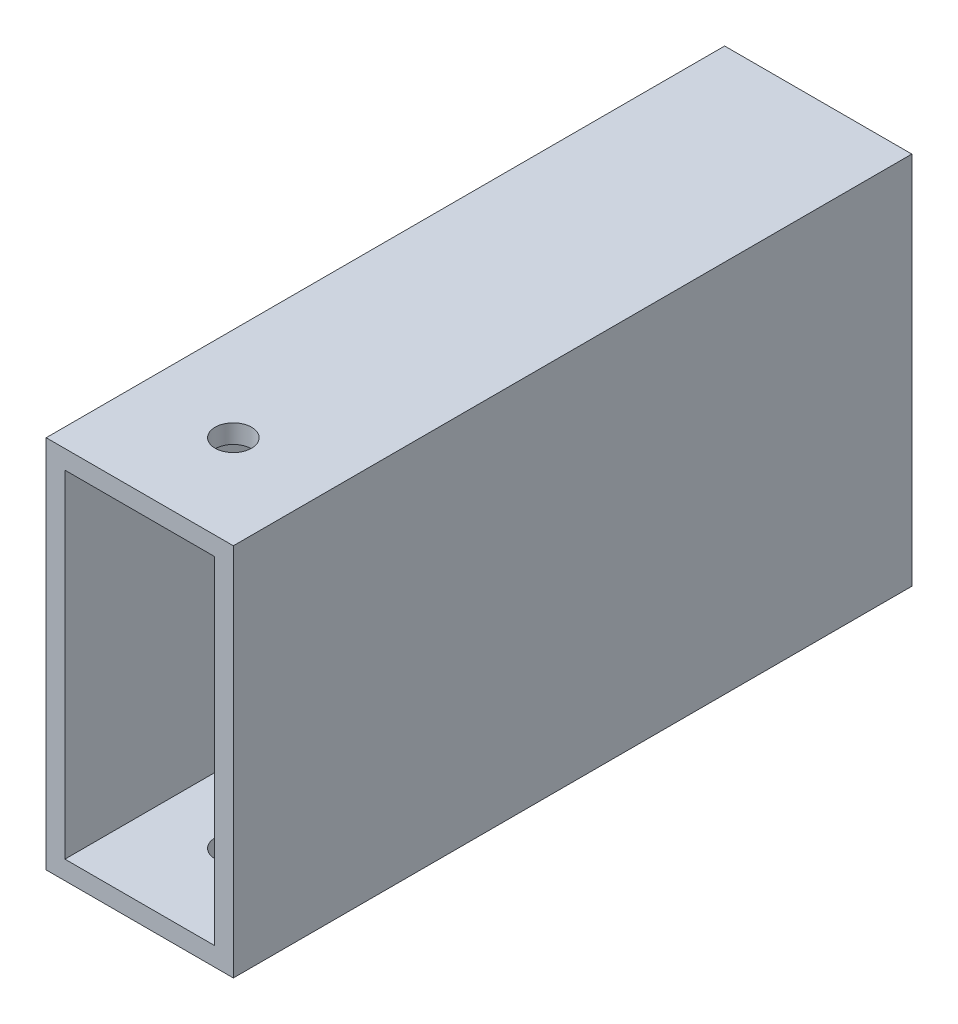
ISO-10303-21;
HEADER;
FILE_DESCRIPTION(('STEP AP214'),'2;1');
FILE_NAME('part.step','',(''),(''),'','','');
FILE_SCHEMA(('AUTOMOTIVE_DESIGN { 1 0 10303 214 1 1 1 1 }'));
ENDSEC;
DATA;
#1=APPLICATION_CONTEXT('core data for automotive mechanical design processes');
#2=APPLICATION_PROTOCOL_DEFINITION('international standard','automotive_design',2000,#1);
#3=PRODUCT_CONTEXT('',#1,'mechanical');
#4=PRODUCT('Part','Part','',(#3));
#5=PRODUCT_RELATED_PRODUCT_CATEGORY('part','',(#4));
#6=PRODUCT_DEFINITION_FORMATION('','',#4);
#7=PRODUCT_DEFINITION_CONTEXT('part definition',#1,'design');
#8=PRODUCT_DEFINITION('design','',#6,#7);
#9=PRODUCT_DEFINITION_SHAPE('','',#8);
#10=(LENGTH_UNIT() NAMED_UNIT(*) SI_UNIT(.MILLI.,.METRE.));
#11=(NAMED_UNIT(*) PLANE_ANGLE_UNIT() SI_UNIT($,.RADIAN.));
#12=(NAMED_UNIT(*) SI_UNIT($,.STERADIAN.) SOLID_ANGLE_UNIT());
#13=UNCERTAINTY_MEASURE_WITH_UNIT(LENGTH_MEASURE(1.E-05),#10,'distance_accuracy_value','');
#14=(GEOMETRIC_REPRESENTATION_CONTEXT(3) GLOBAL_UNCERTAINTY_ASSIGNED_CONTEXT((#13)) GLOBAL_UNIT_ASSIGNED_CONTEXT((#10,
#11,#12)) REPRESENTATION_CONTEXT('',''));
#15=CARTESIAN_POINT('',(0.,0.,0.));
#16=DIRECTION('',(0.,0.,1.));
#17=DIRECTION('',(1.,0.,0.));
#18=AXIS2_PLACEMENT_3D('',#15,#16,#17);
#19=CARTESIAN_POINT('',(0.,0.,46.0375));
#20=DIRECTION('',(0.,0.,1.));
#21=DIRECTION('',(1.,0.,0.));
#22=AXIS2_PLACEMENT_3D('',#19,#20,#21);
#23=PLANE('',#22);
#24=DIRECTION('',(0.,1.,0.));
#25=VECTOR('',#24,1.);
#26=CARTESIAN_POINT('',(12.7,-25.4,46.0375));
#27=LINE('',#26,#25);
#28=CARTESIAN_POINT('',(12.7,-25.4,46.0375));
#29=VERTEX_POINT('',#28);
#30=CARTESIAN_POINT('',(12.7,25.4,46.0375));
#31=VERTEX_POINT('',#30);
#32=EDGE_CURVE('E161',#29,#31,#27,.T.);
#33=ORIENTED_EDGE('',*,*,#32,.T.);
#34=DIRECTION('',(-1.,0.,0.));
#35=VECTOR('',#34,1.);
#36=CARTESIAN_POINT('',(-12.7,25.4,46.0375));
#37=LINE('',#36,#35);
#38=CARTESIAN_POINT('',(-12.7,25.4,46.0375));
#39=VERTEX_POINT('',#38);
#40=EDGE_CURVE('E164',#31,#39,#37,.T.);
#41=ORIENTED_EDGE('',*,*,#40,.T.);
#42=DIRECTION('',(0.,-1.,0.));
#43=VECTOR('',#42,1.);
#44=CARTESIAN_POINT('',(-12.7,-25.4,46.0375));
#45=LINE('',#44,#43);
#46=CARTESIAN_POINT('',(-12.7,-25.4,46.0375));
#47=VERTEX_POINT('',#46);
#48=EDGE_CURVE('E167',#39,#47,#45,.T.);
#49=ORIENTED_EDGE('',*,*,#48,.T.);
#50=DIRECTION('',(1.,0.,0.));
#51=VECTOR('',#50,1.);
#52=CARTESIAN_POINT('',(-12.7,-25.4,46.0375));
#53=LINE('',#52,#51);
#54=EDGE_CURVE('E169',#47,#29,#53,.T.);
#55=ORIENTED_EDGE('',*,*,#54,.T.);
#56=EDGE_LOOP('',(#33,#41,#49,#55));
#57=FACE_BOUND('',#56,.T.);
#58=DIRECTION('',(-1.,0.,0.));
#59=VECTOR('',#58,1.);
#60=CARTESIAN_POINT('',(0.,22.86,46.0375));
#61=LINE('',#60,#59);
#62=CARTESIAN_POINT('',(10.16,22.86,46.0375));
#63=VERTEX_POINT('',#62);
#64=CARTESIAN_POINT('',(-10.16,22.86,46.0375));
#65=VERTEX_POINT('',#64);
#66=EDGE_CURVE('E131',#63,#65,#61,.T.);
#67=ORIENTED_EDGE('',*,*,#66,.F.);
#68=DIRECTION('',(0.,1.,0.));
#69=VECTOR('',#68,1.);
#70=CARTESIAN_POINT('',(10.16,0.,46.0375));
#71=LINE('',#70,#69);
#72=CARTESIAN_POINT('',(10.16,-22.86,46.0375));
#73=VERTEX_POINT('',#72);
#74=EDGE_CURVE('E123',#73,#63,#71,.T.);
#75=ORIENTED_EDGE('',*,*,#74,.F.);
#76=DIRECTION('',(1.,0.,0.));
#77=VECTOR('',#76,1.);
#78=CARTESIAN_POINT('',(0.,-22.86,46.0375));
#79=LINE('',#78,#77);
#80=CARTESIAN_POINT('',(-10.16,-22.86,46.0375));
#81=VERTEX_POINT('',#80);
#82=EDGE_CURVE('E145',#81,#73,#79,.T.);
#83=ORIENTED_EDGE('',*,*,#82,.F.);
#84=DIRECTION('',(0.,-1.,0.));
#85=VECTOR('',#84,1.);
#86=CARTESIAN_POINT('',(-10.16,0.,46.0375));
#87=LINE('',#86,#85);
#88=EDGE_CURVE('E143',#65,#81,#87,.T.);
#89=ORIENTED_EDGE('',*,*,#88,.F.);
#90=EDGE_LOOP('',(#67,#75,#83,#89));
#91=FACE_BOUND('',#90,.T.);
#92=ADVANCED_FACE('F57',(#57,#91),#23,.T.);
#93=CARTESIAN_POINT('',(0.,0.,-46.0375));
#94=DIRECTION('',(0.,0.,1.));
#95=DIRECTION('',(1.,0.,0.));
#96=AXIS2_PLACEMENT_3D('',#93,#94,#95);
#97=PLANE('',#96);
#98=DIRECTION('',(0.,1.,0.));
#99=VECTOR('',#98,1.);
#100=CARTESIAN_POINT('',(12.7,-25.4,-46.0375));
#101=LINE('',#100,#99);
#102=CARTESIAN_POINT('',(12.7,-25.4,-46.0375));
#103=VERTEX_POINT('',#102);
#104=CARTESIAN_POINT('',(12.7,25.4,-46.0375));
#105=VERTEX_POINT('',#104);
#106=EDGE_CURVE('E139',#103,#105,#101,.T.);
#107=ORIENTED_EDGE('',*,*,#106,.F.);
#108=DIRECTION('',(1.,0.,0.));
#109=VECTOR('',#108,1.);
#110=CARTESIAN_POINT('',(-12.7,-25.4,-46.0375));
#111=LINE('',#110,#109);
#112=CARTESIAN_POINT('',(-12.7,-25.4,-46.0375));
#113=VERTEX_POINT('',#112);
#114=EDGE_CURVE('E165',#113,#103,#111,.T.);
#115=ORIENTED_EDGE('',*,*,#114,.F.);
#116=DIRECTION('',(0.,-1.,0.));
#117=VECTOR('',#116,1.);
#118=CARTESIAN_POINT('',(-12.7,-25.4,-46.0375));
#119=LINE('',#118,#117);
#120=CARTESIAN_POINT('',(-12.7,25.4,-46.0375));
#121=VERTEX_POINT('',#120);
#122=EDGE_CURVE('E176',#121,#113,#119,.T.);
#123=ORIENTED_EDGE('',*,*,#122,.F.);
#124=DIRECTION('',(-1.,0.,0.));
#125=VECTOR('',#124,1.);
#126=CARTESIAN_POINT('',(-12.7,25.4,-46.0375));
#127=LINE('',#126,#125);
#128=EDGE_CURVE('E174',#105,#121,#127,.T.);
#129=ORIENTED_EDGE('',*,*,#128,.F.);
#130=EDGE_LOOP('',(#107,#115,#123,#129));
#131=FACE_BOUND('',#130,.T.);
#132=DIRECTION('',(0.,1.,0.));
#133=VECTOR('',#132,1.);
#134=CARTESIAN_POINT('',(10.16,0.,-46.0375));
#135=LINE('',#134,#133);
#136=CARTESIAN_POINT('',(10.16,-22.86,-46.0375));
#137=VERTEX_POINT('',#136);
#138=CARTESIAN_POINT('',(10.16,22.86,-46.0375));
#139=VERTEX_POINT('',#138);
#140=EDGE_CURVE('E81',#137,#139,#135,.T.);
#141=ORIENTED_EDGE('',*,*,#140,.T.);
#142=DIRECTION('',(-1.,0.,0.));
#143=VECTOR('',#142,1.);
#144=CARTESIAN_POINT('',(0.,22.86,-46.0375));
#145=LINE('',#144,#143);
#146=CARTESIAN_POINT('',(-10.16,22.86,-46.0375));
#147=VERTEX_POINT('',#146);
#148=EDGE_CURVE('E138',#139,#147,#145,.T.);
#149=ORIENTED_EDGE('',*,*,#148,.T.);
#150=DIRECTION('',(0.,-1.,0.));
#151=VECTOR('',#150,1.);
#152=CARTESIAN_POINT('',(-10.16,0.,-46.0375));
#153=LINE('',#152,#151);
#154=CARTESIAN_POINT('',(-10.16,-22.86,-46.0375));
#155=VERTEX_POINT('',#154);
#156=EDGE_CURVE('E153',#147,#155,#153,.T.);
#157=ORIENTED_EDGE('',*,*,#156,.T.);
#158=DIRECTION('',(1.,0.,0.));
#159=VECTOR('',#158,1.);
#160=CARTESIAN_POINT('',(0.,-22.86,-46.0375));
#161=LINE('',#160,#159);
#162=EDGE_CURVE('E132',#155,#137,#161,.T.);
#163=ORIENTED_EDGE('',*,*,#162,.T.);
#164=EDGE_LOOP('',(#141,#149,#157,#163));
#165=FACE_BOUND('',#164,.T.);
#166=ADVANCED_FACE('F195',(#131,#165),#97,.F.);
#167=CARTESIAN_POINT('',(12.7,-25.4,46.0375));
#168=DIRECTION('',(-1.,0.,0.));
#169=DIRECTION('',(0.,0.,1.));
#170=AXIS2_PLACEMENT_3D('',#167,#168,#169);
#171=PLANE('',#170);
#172=ORIENTED_EDGE('',*,*,#106,.T.);
#173=DIRECTION('',(0.,0.,-1.));
#174=VECTOR('',#173,1.);
#175=CARTESIAN_POINT('',(12.7,25.4,46.0375));
#176=LINE('',#175,#174);
#177=EDGE_CURVE('E12',#31,#105,#176,.T.);
#178=ORIENTED_EDGE('',*,*,#177,.F.);
#179=ORIENTED_EDGE('',*,*,#32,.F.);
#180=DIRECTION('',(0.,0.,-1.));
#181=VECTOR('',#180,1.);
#182=CARTESIAN_POINT('',(12.7,-25.4,46.0375));
#183=LINE('',#182,#181);
#184=EDGE_CURVE('E171',#29,#103,#183,.T.);
#185=ORIENTED_EDGE('',*,*,#184,.T.);
#186=EDGE_LOOP('',(#172,#178,#179,#185));
#187=FACE_BOUND('',#186,.T.);
#188=ADVANCED_FACE('F59',(#187),#171,.F.);
#189=CARTESIAN_POINT('',(-12.7,25.4,46.0375));
#190=DIRECTION('',(0.,-1.,0.));
#191=DIRECTION('',(0.,0.,-1.));
#192=AXIS2_PLACEMENT_3D('',#189,#190,#191);
#193=PLANE('',#192);
#194=CARTESIAN_POINT('',(-5.10954657056972E-06,25.4,33.3374999999998));
#195=DIRECTION('',(0.,-1.,0.));
#196=DIRECTION('',(0.,0.,-1.));
#197=AXIS2_PLACEMENT_3D('',#194,#195,#196);
#198=CIRCLE('',#197,2.47650000000025);
#199=CARTESIAN_POINT('',(-5.10954657056972E-06,25.4,30.8609999999995));
#200=VERTEX_POINT('',#199);
#201=EDGE_CURVE('E234',#200,#200,#198,.T.);
#202=ORIENTED_EDGE('',*,*,#201,.T.);
#203=EDGE_LOOP('',(#202));
#204=FACE_BOUND('',#203,.T.);
#205=ORIENTED_EDGE('',*,*,#128,.T.);
#206=DIRECTION('',(0.,0.,-1.));
#207=VECTOR('',#206,1.);
#208=CARTESIAN_POINT('',(-12.7,25.4,46.0375));
#209=LINE('',#208,#207);
#210=EDGE_CURVE('E66',#39,#121,#209,.T.);
#211=ORIENTED_EDGE('',*,*,#210,.F.);
#212=ORIENTED_EDGE('',*,*,#40,.F.);
#213=ORIENTED_EDGE('',*,*,#177,.T.);
#214=EDGE_LOOP('',(#205,#211,#212,#213));
#215=FACE_BOUND('',#214,.T.);
#216=ADVANCED_FACE('F205',(#204,#215),#193,.F.);
#217=CARTESIAN_POINT('',(-12.7,-25.4,46.0375));
#218=DIRECTION('',(1.,0.,0.));
#219=DIRECTION('',(0.,0.,-1.));
#220=AXIS2_PLACEMENT_3D('',#217,#218,#219);
#221=PLANE('',#220);
#222=ORIENTED_EDGE('',*,*,#122,.T.);
#223=DIRECTION('',(0.,0.,-1.));
#224=VECTOR('',#223,1.);
#225=CARTESIAN_POINT('',(-12.7,-25.4,46.0375));
#226=LINE('',#225,#224);
#227=EDGE_CURVE('E181',#47,#113,#226,.T.);
#228=ORIENTED_EDGE('',*,*,#227,.F.);
#229=ORIENTED_EDGE('',*,*,#48,.F.);
#230=ORIENTED_EDGE('',*,*,#210,.T.);
#231=EDGE_LOOP('',(#222,#228,#229,#230));
#232=FACE_BOUND('',#231,.T.);
#233=ADVANCED_FACE('F189',(#232),#221,.F.);
#234=CARTESIAN_POINT('',(-12.7,-25.4,46.0375));
#235=DIRECTION('',(0.,1.,0.));
#236=DIRECTION('',(0.,0.,1.));
#237=AXIS2_PLACEMENT_3D('',#234,#235,#236);
#238=PLANE('',#237);
#239=CARTESIAN_POINT('',(-5.10954657056972E-06,-25.4,33.3374999999998));
#240=DIRECTION('',(0.,-1.,0.));
#241=DIRECTION('',(0.,0.,-1.));
#242=AXIS2_PLACEMENT_3D('',#239,#240,#241);
#243=CIRCLE('',#242,2.47650000000025);
#244=CARTESIAN_POINT('',(-5.10954657056972E-06,-25.4,30.8609999999995));
#245=VERTEX_POINT('',#244);
#246=EDGE_CURVE('E232',#245,#245,#243,.T.);
#247=ORIENTED_EDGE('',*,*,#246,.F.);
#248=EDGE_LOOP('',(#247));
#249=FACE_BOUND('',#248,.T.);
#250=ORIENTED_EDGE('',*,*,#114,.T.);
#251=ORIENTED_EDGE('',*,*,#184,.F.);
#252=ORIENTED_EDGE('',*,*,#54,.F.);
#253=ORIENTED_EDGE('',*,*,#227,.T.);
#254=EDGE_LOOP('',(#250,#251,#252,#253));
#255=FACE_BOUND('',#254,.T.);
#256=ADVANCED_FACE('F199',(#249,#255),#238,.F.);
#257=CARTESIAN_POINT('',(10.16,0.,46.0375));
#258=DIRECTION('',(-1.,0.,0.));
#259=DIRECTION('',(0.,0.,1.));
#260=AXIS2_PLACEMENT_3D('',#257,#258,#259);
#261=PLANE('',#260);
#262=ORIENTED_EDGE('',*,*,#140,.F.);
#263=DIRECTION('',(0.,0.,-1.));
#264=VECTOR('',#263,1.);
#265=CARTESIAN_POINT('',(10.16,-22.86,46.0375));
#266=LINE('',#265,#264);
#267=EDGE_CURVE('E127',#73,#137,#266,.T.);
#268=ORIENTED_EDGE('',*,*,#267,.F.);
#269=ORIENTED_EDGE('',*,*,#74,.T.);
#270=DIRECTION('',(0.,0.,-1.));
#271=VECTOR('',#270,1.);
#272=CARTESIAN_POINT('',(10.16,22.86,46.0375));
#273=LINE('',#272,#271);
#274=EDGE_CURVE('E126',#63,#139,#273,.T.);
#275=ORIENTED_EDGE('',*,*,#274,.T.);
#276=EDGE_LOOP('',(#262,#268,#269,#275));
#277=FACE_BOUND('',#276,.T.);
#278=ADVANCED_FACE('F125',(#277),#261,.T.);
#279=CARTESIAN_POINT('',(0.,22.86,46.0375));
#280=DIRECTION('',(0.,-1.,0.));
#281=DIRECTION('',(0.,0.,-1.));
#282=AXIS2_PLACEMENT_3D('',#279,#280,#281);
#283=PLANE('',#282);
#284=CARTESIAN_POINT('',(-5.10954657056972E-06,22.86,33.3374999999998));
#285=DIRECTION('',(0.,-1.,0.));
#286=DIRECTION('',(0.,0.,-1.));
#287=AXIS2_PLACEMENT_3D('',#284,#285,#286);
#288=CIRCLE('',#287,2.47650000000025);
#289=CARTESIAN_POINT('',(-5.10954657056972E-06,22.86,30.8609999999995));
#290=VERTEX_POINT('',#289);
#291=EDGE_CURVE('E151',#290,#290,#288,.T.);
#292=ORIENTED_EDGE('',*,*,#291,.F.);
#293=EDGE_LOOP('',(#292));
#294=FACE_BOUND('',#293,.T.);
#295=ORIENTED_EDGE('',*,*,#148,.F.);
#296=ORIENTED_EDGE('',*,*,#274,.F.);
#297=ORIENTED_EDGE('',*,*,#66,.T.);
#298=DIRECTION('',(0.,0.,-1.));
#299=VECTOR('',#298,1.);
#300=CARTESIAN_POINT('',(-10.16,22.86,46.0375));
#301=LINE('',#300,#299);
#302=EDGE_CURVE('E140',#65,#147,#301,.T.);
#303=ORIENTED_EDGE('',*,*,#302,.T.);
#304=EDGE_LOOP('',(#295,#296,#297,#303));
#305=FACE_BOUND('',#304,.T.);
#306=ADVANCED_FACE('F135',(#294,#305),#283,.T.);
#307=CARTESIAN_POINT('',(-10.16,0.,46.0375));
#308=DIRECTION('',(1.,0.,0.));
#309=DIRECTION('',(0.,0.,-1.));
#310=AXIS2_PLACEMENT_3D('',#307,#308,#309);
#311=PLANE('',#310);
#312=ORIENTED_EDGE('',*,*,#156,.F.);
#313=ORIENTED_EDGE('',*,*,#302,.F.);
#314=ORIENTED_EDGE('',*,*,#88,.T.);
#315=DIRECTION('',(0.,0.,-1.));
#316=VECTOR('',#315,1.);
#317=CARTESIAN_POINT('',(-10.16,-22.86,46.0375));
#318=LINE('',#317,#316);
#319=EDGE_CURVE('E73',#81,#155,#318,.T.);
#320=ORIENTED_EDGE('',*,*,#319,.T.);
#321=EDGE_LOOP('',(#312,#313,#314,#320));
#322=FACE_BOUND('',#321,.T.);
#323=ADVANCED_FACE('F247',(#322),#311,.T.);
#324=CARTESIAN_POINT('',(0.,-22.86,46.0375));
#325=DIRECTION('',(0.,1.,0.));
#326=DIRECTION('',(0.,0.,1.));
#327=AXIS2_PLACEMENT_3D('',#324,#325,#326);
#328=PLANE('',#327);
#329=CARTESIAN_POINT('',(-5.10954657056972E-06,-22.86,33.3374999999998));
#330=DIRECTION('',(0.,1.,0.));
#331=DIRECTION('',(0.,0.,1.));
#332=AXIS2_PLACEMENT_3D('',#329,#330,#331);
#333=CIRCLE('',#332,2.47650000000025);
#334=CARTESIAN_POINT('',(-5.10954657056972E-06,-22.86,35.814));
#335=VERTEX_POINT('',#334);
#336=EDGE_CURVE('E61',#335,#335,#333,.T.);
#337=ORIENTED_EDGE('',*,*,#336,.F.);
#338=EDGE_LOOP('',(#337));
#339=FACE_BOUND('',#338,.T.);
#340=ORIENTED_EDGE('',*,*,#162,.F.);
#341=ORIENTED_EDGE('',*,*,#319,.F.);
#342=ORIENTED_EDGE('',*,*,#82,.T.);
#343=ORIENTED_EDGE('',*,*,#267,.T.);
#344=EDGE_LOOP('',(#340,#341,#342,#343));
#345=FACE_BOUND('',#344,.T.);
#346=ADVANCED_FACE('F245',(#339,#345),#328,.T.);
#347=CARTESIAN_POINT('',(-5.10954657056972E-06,25.4,33.3374999999998));
#348=DIRECTION('',(0.,-1.,0.));
#349=DIRECTION('',(0.,0.,-1.));
#350=AXIS2_PLACEMENT_3D('',#347,#348,#349);
#351=CYLINDRICAL_SURFACE('',#350,2.47650000000025);
#352=ORIENTED_EDGE('',*,*,#336,.T.);
#353=EDGE_LOOP('',(#352));
#354=FACE_BOUND('',#353,.T.);
#355=ORIENTED_EDGE('',*,*,#246,.T.);
#356=EDGE_LOOP('',(#355));
#357=FACE_BOUND('',#356,.T.);
#358=ADVANCED_FACE('F243',(#354,#357),#351,.F.);
#359=ORIENTED_EDGE('',*,*,#291,.T.);
#360=EDGE_LOOP('',(#359));
#361=FACE_BOUND('',#360,.T.);
#362=ORIENTED_EDGE('',*,*,#201,.F.);
#363=EDGE_LOOP('',(#362));
#364=FACE_BOUND('',#363,.T.);
#365=ADVANCED_FACE('F259',(#361,#364),#351,.F.);
#366=CLOSED_SHELL('',(#92,#166,#188,#216,#233,#256,#278,#306,#323,#346,#358,#365));
#367=MANIFOLD_SOLID_BREP('B2',#366);
#368=ADVANCED_BREP_SHAPE_REPRESENTATION('',(#18,#367),#14);
#369=SHAPE_DEFINITION_REPRESENTATION(#9,#368);
ENDSEC;
END-ISO-10303-21;
